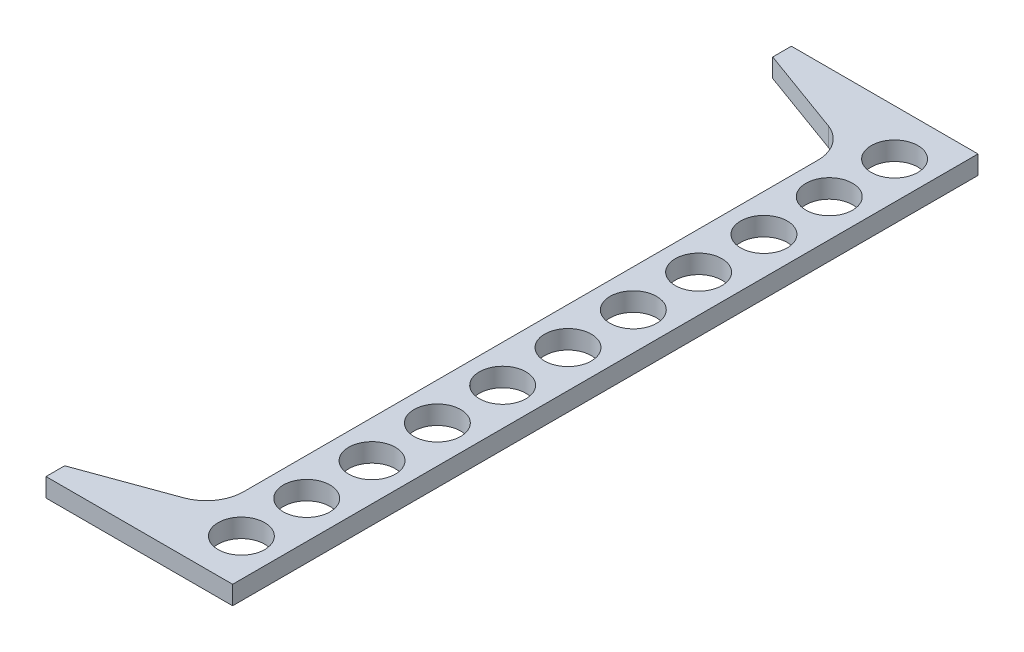
ISO-10303-21;
HEADER;
FILE_DESCRIPTION(('STEP AP214'),'2;1');
FILE_NAME('part.step','',(''),(''),'','','');
FILE_SCHEMA(('AUTOMOTIVE_DESIGN { 1 0 10303 214 1 1 1 1 }'));
ENDSEC;
DATA;
#1=APPLICATION_CONTEXT('core data for automotive mechanical design processes');
#2=APPLICATION_PROTOCOL_DEFINITION('international standard','automotive_design',2000,#1);
#3=PRODUCT_CONTEXT('',#1,'mechanical');
#4=PRODUCT('Part','Part','',(#3));
#5=PRODUCT_RELATED_PRODUCT_CATEGORY('part','',(#4));
#6=PRODUCT_DEFINITION_FORMATION('','',#4);
#7=PRODUCT_DEFINITION_CONTEXT('part definition',#1,'design');
#8=PRODUCT_DEFINITION('design','',#6,#7);
#9=PRODUCT_DEFINITION_SHAPE('','',#8);
#10=(LENGTH_UNIT() NAMED_UNIT(*) SI_UNIT(.MILLI.,.METRE.));
#11=(NAMED_UNIT(*) PLANE_ANGLE_UNIT() SI_UNIT($,.RADIAN.));
#12=(NAMED_UNIT(*) SI_UNIT($,.STERADIAN.) SOLID_ANGLE_UNIT());
#13=UNCERTAINTY_MEASURE_WITH_UNIT(LENGTH_MEASURE(1.E-05),#10,'distance_accuracy_value','');
#14=(GEOMETRIC_REPRESENTATION_CONTEXT(3) GLOBAL_UNCERTAINTY_ASSIGNED_CONTEXT((#13)) GLOBAL_UNIT_ASSIGNED_CONTEXT((#10,
#11,#12)) REPRESENTATION_CONTEXT('',''));
#15=CARTESIAN_POINT('',(0.,0.,0.));
#16=DIRECTION('',(0.,0.,1.));
#17=DIRECTION('',(1.,0.,0.));
#18=AXIS2_PLACEMENT_3D('',#15,#16,#17);
#19=CARTESIAN_POINT('',(50.8,6.35,-111.125));
#20=DIRECTION('',(0.,1.,0.));
#21=DIRECTION('',(0.,0.,1.));
#22=AXIS2_PLACEMENT_3D('',#19,#20,#21);
#23=CYLINDRICAL_SURFACE('',#22,7.9375);
#24=CARTESIAN_POINT('',(50.8,6.35,-111.125));
#25=DIRECTION('',(0.,1.,0.));
#26=DIRECTION('',(0.,0.,1.));
#27=AXIS2_PLACEMENT_3D('',#24,#25,#26);
#28=CIRCLE('',#27,7.9375);
#29=CARTESIAN_POINT('',(50.8,6.35,-103.1875));
#30=VERTEX_POINT('',#29);
#31=EDGE_CURVE('E40',#30,#30,#28,.T.);
#32=ORIENTED_EDGE('',*,*,#31,.T.);
#33=EDGE_LOOP('',(#32));
#34=FACE_BOUND('',#33,.T.);
#35=CARTESIAN_POINT('',(50.8,0.,-111.125));
#36=DIRECTION('',(0.,1.,0.));
#37=DIRECTION('',(0.,0.,1.));
#38=AXIS2_PLACEMENT_3D('',#35,#36,#37);
#39=CIRCLE('',#38,7.9375);
#40=CARTESIAN_POINT('',(50.8,0.,-103.1875));
#41=VERTEX_POINT('',#40);
#42=EDGE_CURVE('E11',#41,#41,#39,.T.);
#43=ORIENTED_EDGE('',*,*,#42,.F.);
#44=EDGE_LOOP('',(#43));
#45=FACE_BOUND('',#44,.T.);
#46=ADVANCED_FACE('F33',(#34,#45),#23,.F.);
#47=CARTESIAN_POINT('',(50.8,6.35,-88.9));
#48=DIRECTION('',(0.,1.,0.));
#49=DIRECTION('',(0.,0.,1.));
#50=AXIS2_PLACEMENT_3D('',#47,#48,#49);
#51=CYLINDRICAL_SURFACE('',#50,7.9375);
#52=CARTESIAN_POINT('',(50.8,6.35,-88.9));
#53=DIRECTION('',(0.,1.,0.));
#54=DIRECTION('',(0.,0.,1.));
#55=AXIS2_PLACEMENT_3D('',#52,#53,#54);
#56=CIRCLE('',#55,7.9375);
#57=CARTESIAN_POINT('',(50.8,6.35,-80.9625));
#58=VERTEX_POINT('',#57);
#59=EDGE_CURVE('E193',#58,#58,#56,.T.);
#60=ORIENTED_EDGE('',*,*,#59,.T.);
#61=EDGE_LOOP('',(#60));
#62=FACE_BOUND('',#61,.T.);
#63=CARTESIAN_POINT('',(50.8,0.,-88.9));
#64=DIRECTION('',(0.,1.,0.));
#65=DIRECTION('',(0.,0.,1.));
#66=AXIS2_PLACEMENT_3D('',#63,#64,#65);
#67=CIRCLE('',#66,7.9375);
#68=CARTESIAN_POINT('',(50.8,0.,-80.9625));
#69=VERTEX_POINT('',#68);
#70=EDGE_CURVE('E196',#69,#69,#67,.T.);
#71=ORIENTED_EDGE('',*,*,#70,.F.);
#72=EDGE_LOOP('',(#71));
#73=FACE_BOUND('',#72,.T.);
#74=ADVANCED_FACE('F220',(#62,#73),#51,.F.);
#75=CARTESIAN_POINT('',(50.8,6.35,-66.675));
#76=DIRECTION('',(0.,1.,0.));
#77=DIRECTION('',(0.,0.,1.));
#78=AXIS2_PLACEMENT_3D('',#75,#76,#77);
#79=CYLINDRICAL_SURFACE('',#78,7.9375);
#80=CARTESIAN_POINT('',(50.8,6.35,-66.675));
#81=DIRECTION('',(0.,1.,0.));
#82=DIRECTION('',(0.,0.,1.));
#83=AXIS2_PLACEMENT_3D('',#80,#81,#82);
#84=CIRCLE('',#83,7.9375);
#85=CARTESIAN_POINT('',(50.8,6.35,-58.7375));
#86=VERTEX_POINT('',#85);
#87=EDGE_CURVE('E187',#86,#86,#84,.T.);
#88=ORIENTED_EDGE('',*,*,#87,.T.);
#89=EDGE_LOOP('',(#88));
#90=FACE_BOUND('',#89,.T.);
#91=CARTESIAN_POINT('',(50.8,0.,-66.675));
#92=DIRECTION('',(0.,1.,0.));
#93=DIRECTION('',(0.,0.,1.));
#94=AXIS2_PLACEMENT_3D('',#91,#92,#93);
#95=CIRCLE('',#94,7.9375);
#96=CARTESIAN_POINT('',(50.8,0.,-58.7375));
#97=VERTEX_POINT('',#96);
#98=EDGE_CURVE('E190',#97,#97,#95,.T.);
#99=ORIENTED_EDGE('',*,*,#98,.F.);
#100=EDGE_LOOP('',(#99));
#101=FACE_BOUND('',#100,.T.);
#102=ADVANCED_FACE('F224',(#90,#101),#79,.F.);
#103=CARTESIAN_POINT('',(50.8,6.35,-44.45));
#104=DIRECTION('',(0.,1.,0.));
#105=DIRECTION('',(0.,0.,1.));
#106=AXIS2_PLACEMENT_3D('',#103,#104,#105);
#107=CYLINDRICAL_SURFACE('',#106,7.9375);
#108=CARTESIAN_POINT('',(50.8,6.35,-44.45));
#109=DIRECTION('',(0.,1.,0.));
#110=DIRECTION('',(0.,0.,1.));
#111=AXIS2_PLACEMENT_3D('',#108,#109,#110);
#112=CIRCLE('',#111,7.9375);
#113=CARTESIAN_POINT('',(50.8,6.35,-36.5125));
#114=VERTEX_POINT('',#113);
#115=EDGE_CURVE('E181',#114,#114,#112,.T.);
#116=ORIENTED_EDGE('',*,*,#115,.T.);
#117=EDGE_LOOP('',(#116));
#118=FACE_BOUND('',#117,.T.);
#119=CARTESIAN_POINT('',(50.8,0.,-44.45));
#120=DIRECTION('',(0.,1.,0.));
#121=DIRECTION('',(0.,0.,1.));
#122=AXIS2_PLACEMENT_3D('',#119,#120,#121);
#123=CIRCLE('',#122,7.9375);
#124=CARTESIAN_POINT('',(50.8,0.,-36.5125));
#125=VERTEX_POINT('',#124);
#126=EDGE_CURVE('E184',#125,#125,#123,.T.);
#127=ORIENTED_EDGE('',*,*,#126,.F.);
#128=EDGE_LOOP('',(#127));
#129=FACE_BOUND('',#128,.T.);
#130=ADVANCED_FACE('F229',(#118,#129),#107,.F.);
#131=CARTESIAN_POINT('',(0.,0.,126.8095));
#132=DIRECTION('',(-1.,0.,0.));
#133=DIRECTION('',(0.,0.,1.));
#134=AXIS2_PLACEMENT_3D('',#131,#132,#133);
#135=PLANE('',#134);
#136=DIRECTION('',(0.,-1.,0.));
#137=VECTOR('',#136,1.);
#138=CARTESIAN_POINT('',(0.,341.193377272515,-120.4595));
#139=LINE('',#138,#137);
#140=CARTESIAN_POINT('',(0.,6.35,-120.4595));
#141=VERTEX_POINT('',#140);
#142=CARTESIAN_POINT('',(0.,0.,-120.4595));
#143=VERTEX_POINT('',#142);
#144=EDGE_CURVE('E260',#141,#143,#139,.T.);
#145=ORIENTED_EDGE('',*,*,#144,.F.);
#146=DIRECTION('',(0.,0.,-1.));
#147=VECTOR('',#146,1.);
#148=CARTESIAN_POINT('',(0.,6.35,126.8095));
#149=LINE('',#148,#147);
#150=CARTESIAN_POINT('',(0.,6.35,-126.8095));
#151=VERTEX_POINT('',#150);
#152=EDGE_CURVE('E120',#141,#151,#149,.T.);
#153=ORIENTED_EDGE('',*,*,#152,.T.);
#154=DIRECTION('',(0.,1.,0.));
#155=VECTOR('',#154,1.);
#156=CARTESIAN_POINT('',(0.,0.,-126.8095));
#157=LINE('',#156,#155);
#158=CARTESIAN_POINT('',(0.,0.,-126.8095));
#159=VERTEX_POINT('',#158);
#160=EDGE_CURVE('E145',#159,#151,#157,.T.);
#161=ORIENTED_EDGE('',*,*,#160,.F.);
#162=DIRECTION('',(0.,0.,-1.));
#163=VECTOR('',#162,1.);
#164=CARTESIAN_POINT('',(0.,0.,126.8095));
#165=LINE('',#164,#163);
#166=EDGE_CURVE('E154',#143,#159,#165,.T.);
#167=ORIENTED_EDGE('',*,*,#166,.F.);
#168=EDGE_LOOP('',(#145,#153,#161,#167));
#169=FACE_BOUND('',#168,.T.);
#170=ADVANCED_FACE('F236',(#169),#135,.T.);
#171=DIRECTION('',(0.,-1.,0.));
#172=VECTOR('',#171,1.);
#173=CARTESIAN_POINT('',(0.,341.193377272515,120.4595));
#174=LINE('',#173,#172);
#175=CARTESIAN_POINT('',(0.,6.35,120.4595));
#176=VERTEX_POINT('',#175);
#177=CARTESIAN_POINT('',(0.,0.,120.4595));
#178=VERTEX_POINT('',#177);
#179=EDGE_CURVE('E265',#176,#178,#174,.T.);
#180=ORIENTED_EDGE('',*,*,#179,.T.);
#181=CARTESIAN_POINT('',(0.,0.,126.8095));
#182=VERTEX_POINT('',#181);
#183=EDGE_CURVE('E132',#182,#178,#165,.T.);
#184=ORIENTED_EDGE('',*,*,#183,.F.);
#185=DIRECTION('',(0.,1.,0.));
#186=VECTOR('',#185,1.);
#187=CARTESIAN_POINT('',(0.,0.,126.8095));
#188=LINE('',#187,#186);
#189=CARTESIAN_POINT('',(0.,6.35,126.8095));
#190=VERTEX_POINT('',#189);
#191=EDGE_CURVE('E125',#182,#190,#188,.T.);
#192=ORIENTED_EDGE('',*,*,#191,.T.);
#193=EDGE_CURVE('E109',#190,#176,#149,.T.);
#194=ORIENTED_EDGE('',*,*,#193,.T.);
#195=EDGE_LOOP('',(#180,#184,#192,#194));
#196=FACE_BOUND('',#195,.T.);
#197=ADVANCED_FACE('F130',(#196),#135,.T.);
#198=CARTESIAN_POINT('',(0.,0.,126.8095));
#199=DIRECTION('',(0.,1.,0.));
#200=DIRECTION('',(0.,0.,1.));
#201=AXIS2_PLACEMENT_3D('',#198,#199,#200);
#202=PLANE('',#201);
#203=CARTESIAN_POINT('',(50.8,0.,111.125));
#204=DIRECTION('',(0.,1.,0.));
#205=DIRECTION('',(0.,0.,1.));
#206=AXIS2_PLACEMENT_3D('',#203,#204,#205);
#207=CIRCLE('',#206,7.9375);
#208=CARTESIAN_POINT('',(50.8,0.,119.0625));
#209=VERTEX_POINT('',#208);
#210=EDGE_CURVE('E315',#209,#209,#207,.T.);
#211=ORIENTED_EDGE('',*,*,#210,.T.);
#212=EDGE_LOOP('',(#211));
#213=FACE_BOUND('',#212,.T.);
#214=CARTESIAN_POINT('',(50.8,0.,88.9));
#215=DIRECTION('',(0.,1.,0.));
#216=DIRECTION('',(0.,0.,1.));
#217=AXIS2_PLACEMENT_3D('',#214,#215,#216);
#218=CIRCLE('',#217,7.9375);
#219=CARTESIAN_POINT('',(50.8,0.,96.8375));
#220=VERTEX_POINT('',#219);
#221=EDGE_CURVE('E309',#220,#220,#218,.T.);
#222=ORIENTED_EDGE('',*,*,#221,.T.);
#223=EDGE_LOOP('',(#222));
#224=FACE_BOUND('',#223,.T.);
#225=CARTESIAN_POINT('',(50.8,0.,66.675));
#226=DIRECTION('',(0.,1.,0.));
#227=DIRECTION('',(0.,0.,1.));
#228=AXIS2_PLACEMENT_3D('',#225,#226,#227);
#229=CIRCLE('',#228,7.9375);
#230=CARTESIAN_POINT('',(50.8,0.,74.6125));
#231=VERTEX_POINT('',#230);
#232=EDGE_CURVE('E303',#231,#231,#229,.T.);
#233=ORIENTED_EDGE('',*,*,#232,.T.);
#234=EDGE_LOOP('',(#233));
#235=FACE_BOUND('',#234,.T.);
#236=CARTESIAN_POINT('',(50.8,0.,44.45));
#237=DIRECTION('',(0.,1.,0.));
#238=DIRECTION('',(0.,0.,1.));
#239=AXIS2_PLACEMENT_3D('',#236,#237,#238);
#240=CIRCLE('',#239,7.9375);
#241=CARTESIAN_POINT('',(50.8,0.,52.3875));
#242=VERTEX_POINT('',#241);
#243=EDGE_CURVE('E297',#242,#242,#240,.T.);
#244=ORIENTED_EDGE('',*,*,#243,.T.);
#245=EDGE_LOOP('',(#244));
#246=FACE_BOUND('',#245,.T.);
#247=CARTESIAN_POINT('',(50.8,0.,22.225));
#248=DIRECTION('',(0.,1.,0.));
#249=DIRECTION('',(0.,0.,1.));
#250=AXIS2_PLACEMENT_3D('',#247,#248,#249);
#251=CIRCLE('',#250,7.9375);
#252=CARTESIAN_POINT('',(50.8,0.,30.1625));
#253=VERTEX_POINT('',#252);
#254=EDGE_CURVE('E291',#253,#253,#251,.T.);
#255=ORIENTED_EDGE('',*,*,#254,.T.);
#256=EDGE_LOOP('',(#255));
#257=FACE_BOUND('',#256,.T.);
#258=CARTESIAN_POINT('',(50.8,0.,-22.225));
#259=DIRECTION('',(0.,1.,0.));
#260=DIRECTION('',(0.,0.,1.));
#261=AXIS2_PLACEMENT_3D('',#258,#259,#260);
#262=CIRCLE('',#261,7.9375);
#263=CARTESIAN_POINT('',(50.8,0.,-14.2875));
#264=VERTEX_POINT('',#263);
#265=EDGE_CURVE('E285',#264,#264,#262,.T.);
#266=ORIENTED_EDGE('',*,*,#265,.T.);
#267=EDGE_LOOP('',(#266));
#268=FACE_BOUND('',#267,.T.);
#269=CARTESIAN_POINT('',(50.8,0.,0.));
#270=DIRECTION('',(0.,1.,0.));
#271=DIRECTION('',(0.,0.,1.));
#272=AXIS2_PLACEMENT_3D('',#269,#270,#271);
#273=CIRCLE('',#272,7.9375);
#274=CARTESIAN_POINT('',(50.8,0.,7.9375));
#275=VERTEX_POINT('',#274);
#276=EDGE_CURVE('E279',#275,#275,#273,.T.);
#277=ORIENTED_EDGE('',*,*,#276,.T.);
#278=EDGE_LOOP('',(#277));
#279=FACE_BOUND('',#278,.T.);
#280=DIRECTION('',(0.939692620785911,0.,-0.342020143325663));
#281=VECTOR('',#280,1.);
#282=CARTESIAN_POINT('',(-2.04085066075473,0.,121.202308893097));
#283=LINE('',#282,#281);
#284=CARTESIAN_POINT('',(29.743655820236,0.,109.633694623176));
#285=VERTEX_POINT('',#284);
#286=EDGE_CURVE('E264',#178,#285,#283,.T.);
#287=ORIENTED_EDGE('',*,*,#286,.T.);
#288=CARTESIAN_POINT('',(25.4,0.,97.6995983391946));
#289=DIRECTION('',(0.,1.,0.));
#290=DIRECTION('',(0.,0.,1.));
#291=AXIS2_PLACEMENT_3D('',#288,#289,#290);
#292=CIRCLE('',#291,12.7);
#293=CARTESIAN_POINT('',(38.1,0.,97.6995983391946));
#294=VERTEX_POINT('',#293);
#295=EDGE_CURVE('E174',#285,#294,#292,.T.);
#296=ORIENTED_EDGE('',*,*,#295,.T.);
#297=DIRECTION('',(0.,0.,-1.));
#298=VECTOR('',#297,1.);
#299=CARTESIAN_POINT('',(38.1,0.,126.8095));
#300=LINE('',#299,#298);
#301=CARTESIAN_POINT('',(38.1,0.,-97.6995983391944));
#302=VERTEX_POINT('',#301);
#303=EDGE_CURVE('E274',#294,#302,#300,.T.);
#304=ORIENTED_EDGE('',*,*,#303,.T.);
#305=CARTESIAN_POINT('',(25.4,0.,-97.6995983391944));
#306=DIRECTION('',(0.,1.,0.));
#307=DIRECTION('',(0.,0.,1.));
#308=AXIS2_PLACEMENT_3D('',#305,#306,#307);
#309=CIRCLE('',#308,12.7);
#310=CARTESIAN_POINT('',(29.743655820236,0.,-109.633694623175));
#311=VERTEX_POINT('',#310);
#312=EDGE_CURVE('E55',#302,#311,#309,.T.);
#313=ORIENTED_EDGE('',*,*,#312,.T.);
#314=DIRECTION('',(-0.939692620785908,0.,-0.342020143325669));
#315=VECTOR('',#314,1.);
#316=CARTESIAN_POINT('',(79.4707247297906,0.,-91.5345217027932));
#317=LINE('',#316,#315);
#318=EDGE_CURVE('E139',#311,#143,#317,.T.);
#319=ORIENTED_EDGE('',*,*,#318,.T.);
#320=ORIENTED_EDGE('',*,*,#166,.T.);
#321=DIRECTION('',(1.,0.,0.));
#322=VECTOR('',#321,1.);
#323=CARTESIAN_POINT('',(0.,0.,-126.8095));
#324=LINE('',#323,#322);
#325=CARTESIAN_POINT('',(63.5,0.,-126.8095));
#326=VERTEX_POINT('',#325);
#327=EDGE_CURVE('E134',#159,#326,#324,.T.);
#328=ORIENTED_EDGE('',*,*,#327,.T.);
#329=DIRECTION('',(0.,0.,-1.));
#330=VECTOR('',#329,1.);
#331=CARTESIAN_POINT('',(63.5,0.,126.8095));
#332=LINE('',#331,#330);
#333=CARTESIAN_POINT('',(63.5,0.,126.8095));
#334=VERTEX_POINT('',#333);
#335=EDGE_CURVE('E155',#334,#326,#332,.T.);
#336=ORIENTED_EDGE('',*,*,#335,.F.);
#337=DIRECTION('',(1.,0.,0.));
#338=VECTOR('',#337,1.);
#339=CARTESIAN_POINT('',(0.,0.,126.8095));
#340=LINE('',#339,#338);
#341=EDGE_CURVE('E143',#182,#334,#340,.T.);
#342=ORIENTED_EDGE('',*,*,#341,.F.);
#343=ORIENTED_EDGE('',*,*,#183,.T.);
#344=EDGE_LOOP('',(#287,#296,#304,#313,#319,#320,#328,#336,#342,#343));
#345=FACE_BOUND('',#344,.T.);
#346=ORIENTED_EDGE('',*,*,#126,.T.);
#347=EDGE_LOOP('',(#346));
#348=FACE_BOUND('',#347,.T.);
#349=ORIENTED_EDGE('',*,*,#98,.T.);
#350=EDGE_LOOP('',(#349));
#351=FACE_BOUND('',#350,.T.);
#352=ORIENTED_EDGE('',*,*,#70,.T.);
#353=EDGE_LOOP('',(#352));
#354=FACE_BOUND('',#353,.T.);
#355=ORIENTED_EDGE('',*,*,#42,.T.);
#356=EDGE_LOOP('',(#355));
#357=FACE_BOUND('',#356,.T.);
#358=ADVANCED_FACE('F213',(#213,#224,#235,#246,#257,#268,#279,#345,#348,#351,#354,#357),#202,.F.);
#359=CARTESIAN_POINT('',(63.5,0.,126.8095));
#360=DIRECTION('',(-1.,0.,0.));
#361=DIRECTION('',(0.,0.,1.));
#362=AXIS2_PLACEMENT_3D('',#359,#360,#361);
#363=PLANE('',#362);
#364=DIRECTION('',(0.,1.,0.));
#365=VECTOR('',#364,1.);
#366=CARTESIAN_POINT('',(63.5,0.,-126.8095));
#367=LINE('',#366,#365);
#368=CARTESIAN_POINT('',(63.5,6.35,-126.8095));
#369=VERTEX_POINT('',#368);
#370=EDGE_CURVE('E136',#326,#369,#367,.T.);
#371=ORIENTED_EDGE('',*,*,#370,.T.);
#372=DIRECTION('',(0.,0.,-1.));
#373=VECTOR('',#372,1.);
#374=CARTESIAN_POINT('',(63.5,6.35,126.8095));
#375=LINE('',#374,#373);
#376=CARTESIAN_POINT('',(63.5,6.35,126.8095));
#377=VERTEX_POINT('',#376);
#378=EDGE_CURVE('E119',#377,#369,#375,.T.);
#379=ORIENTED_EDGE('',*,*,#378,.F.);
#380=DIRECTION('',(0.,1.,0.));
#381=VECTOR('',#380,1.);
#382=CARTESIAN_POINT('',(63.5,0.,126.8095));
#383=LINE('',#382,#381);
#384=EDGE_CURVE('E127',#334,#377,#383,.T.);
#385=ORIENTED_EDGE('',*,*,#384,.F.);
#386=ORIENTED_EDGE('',*,*,#335,.T.);
#387=EDGE_LOOP('',(#371,#379,#385,#386));
#388=FACE_BOUND('',#387,.T.);
#389=ADVANCED_FACE('F204',(#388),#363,.F.);
#390=CARTESIAN_POINT('',(0.,6.35,126.8095));
#391=DIRECTION('',(0.,1.,0.));
#392=DIRECTION('',(0.,0.,1.));
#393=AXIS2_PLACEMENT_3D('',#390,#391,#392);
#394=PLANE('',#393);
#395=CARTESIAN_POINT('',(50.8,6.35,111.125));
#396=DIRECTION('',(0.,1.,0.));
#397=DIRECTION('',(0.,0.,1.));
#398=AXIS2_PLACEMENT_3D('',#395,#396,#397);
#399=CIRCLE('',#398,7.9375);
#400=CARTESIAN_POINT('',(50.8,6.35,119.0625));
#401=VERTEX_POINT('',#400);
#402=EDGE_CURVE('E318',#401,#401,#399,.T.);
#403=ORIENTED_EDGE('',*,*,#402,.F.);
#404=EDGE_LOOP('',(#403));
#405=FACE_BOUND('',#404,.T.);
#406=CARTESIAN_POINT('',(50.8,6.35,88.9));
#407=DIRECTION('',(0.,1.,0.));
#408=DIRECTION('',(0.,0.,1.));
#409=AXIS2_PLACEMENT_3D('',#406,#407,#408);
#410=CIRCLE('',#409,7.9375);
#411=CARTESIAN_POINT('',(50.8,6.35,96.8375));
#412=VERTEX_POINT('',#411);
#413=EDGE_CURVE('E312',#412,#412,#410,.T.);
#414=ORIENTED_EDGE('',*,*,#413,.F.);
#415=EDGE_LOOP('',(#414));
#416=FACE_BOUND('',#415,.T.);
#417=CARTESIAN_POINT('',(50.8,6.35,66.675));
#418=DIRECTION('',(0.,1.,0.));
#419=DIRECTION('',(0.,0.,1.));
#420=AXIS2_PLACEMENT_3D('',#417,#418,#419);
#421=CIRCLE('',#420,7.9375);
#422=CARTESIAN_POINT('',(50.8,6.35,74.6125));
#423=VERTEX_POINT('',#422);
#424=EDGE_CURVE('E306',#423,#423,#421,.T.);
#425=ORIENTED_EDGE('',*,*,#424,.F.);
#426=EDGE_LOOP('',(#425));
#427=FACE_BOUND('',#426,.T.);
#428=CARTESIAN_POINT('',(50.8,6.35,44.45));
#429=DIRECTION('',(0.,1.,0.));
#430=DIRECTION('',(0.,0.,1.));
#431=AXIS2_PLACEMENT_3D('',#428,#429,#430);
#432=CIRCLE('',#431,7.9375);
#433=CARTESIAN_POINT('',(50.8,6.35,52.3875));
#434=VERTEX_POINT('',#433);
#435=EDGE_CURVE('E300',#434,#434,#432,.T.);
#436=ORIENTED_EDGE('',*,*,#435,.F.);
#437=EDGE_LOOP('',(#436));
#438=FACE_BOUND('',#437,.T.);
#439=CARTESIAN_POINT('',(50.8,6.35,22.225));
#440=DIRECTION('',(0.,1.,0.));
#441=DIRECTION('',(0.,0.,1.));
#442=AXIS2_PLACEMENT_3D('',#439,#440,#441);
#443=CIRCLE('',#442,7.9375);
#444=CARTESIAN_POINT('',(50.8,6.35,30.1625));
#445=VERTEX_POINT('',#444);
#446=EDGE_CURVE('E294',#445,#445,#443,.T.);
#447=ORIENTED_EDGE('',*,*,#446,.F.);
#448=EDGE_LOOP('',(#447));
#449=FACE_BOUND('',#448,.T.);
#450=CARTESIAN_POINT('',(50.8,6.35,-22.225));
#451=DIRECTION('',(0.,1.,0.));
#452=DIRECTION('',(0.,0.,1.));
#453=AXIS2_PLACEMENT_3D('',#450,#451,#452);
#454=CIRCLE('',#453,7.9375);
#455=CARTESIAN_POINT('',(50.8,6.35,-14.2875));
#456=VERTEX_POINT('',#455);
#457=EDGE_CURVE('E288',#456,#456,#454,.T.);
#458=ORIENTED_EDGE('',*,*,#457,.F.);
#459=EDGE_LOOP('',(#458));
#460=FACE_BOUND('',#459,.T.);
#461=CARTESIAN_POINT('',(50.8,6.35,0.));
#462=DIRECTION('',(0.,1.,0.));
#463=DIRECTION('',(0.,0.,1.));
#464=AXIS2_PLACEMENT_3D('',#461,#462,#463);
#465=CIRCLE('',#464,7.9375);
#466=CARTESIAN_POINT('',(50.8,6.35,7.9375));
#467=VERTEX_POINT('',#466);
#468=EDGE_CURVE('E282',#467,#467,#465,.T.);
#469=ORIENTED_EDGE('',*,*,#468,.F.);
#470=EDGE_LOOP('',(#469));
#471=FACE_BOUND('',#470,.T.);
#472=DIRECTION('',(-0.939692620785908,0.,-0.342020143325669));
#473=VECTOR('',#472,1.);
#474=CARTESIAN_POINT('',(79.4707247297906,6.35,-91.5345217027932));
#475=LINE('',#474,#473);
#476=CARTESIAN_POINT('',(29.743655820236,6.35,-109.633694623175));
#477=VERTEX_POINT('',#476);
#478=EDGE_CURVE('E163',#477,#141,#475,.T.);
#479=ORIENTED_EDGE('',*,*,#478,.F.);
#480=CARTESIAN_POINT('',(25.4,6.35000000000002,-97.6995983391944));
#481=DIRECTION('',(0.,1.,0.));
#482=DIRECTION('',(0.,0.,1.));
#483=AXIS2_PLACEMENT_3D('',#480,#481,#482);
#484=CIRCLE('',#483,12.7);
#485=CARTESIAN_POINT('',(38.1,6.35,-97.6995983391944));
#486=VERTEX_POINT('',#485);
#487=EDGE_CURVE('E179',#477,#486,#484,.F.);
#488=ORIENTED_EDGE('',*,*,#487,.T.);
#489=DIRECTION('',(0.,0.,-1.));
#490=VECTOR('',#489,1.);
#491=CARTESIAN_POINT('',(38.1,6.35,126.8095));
#492=LINE('',#491,#490);
#493=CARTESIAN_POINT('',(38.1,6.35,97.6995983391946));
#494=VERTEX_POINT('',#493);
#495=EDGE_CURVE('E160',#494,#486,#492,.T.);
#496=ORIENTED_EDGE('',*,*,#495,.F.);
#497=CARTESIAN_POINT('',(25.4,6.35000000000002,97.6995983391946));
#498=DIRECTION('',(0.,1.,0.));
#499=DIRECTION('',(0.,0.,1.));
#500=AXIS2_PLACEMENT_3D('',#497,#498,#499);
#501=CIRCLE('',#500,12.7);
#502=CARTESIAN_POINT('',(29.743655820236,6.35,109.633694623176));
#503=VERTEX_POINT('',#502);
#504=EDGE_CURVE('E176',#494,#503,#501,.F.);
#505=ORIENTED_EDGE('',*,*,#504,.T.);
#506=DIRECTION('',(0.939692620785911,0.,-0.342020143325663));
#507=VECTOR('',#506,1.);
#508=CARTESIAN_POINT('',(-2.04085066075473,6.35,121.202308893097));
#509=LINE('',#508,#507);
#510=EDGE_CURVE('E115',#176,#503,#509,.T.);
#511=ORIENTED_EDGE('',*,*,#510,.F.);
#512=ORIENTED_EDGE('',*,*,#193,.F.);
#513=DIRECTION('',(1.,0.,0.));
#514=VECTOR('',#513,1.);
#515=CARTESIAN_POINT('',(0.,6.35,126.8095));
#516=LINE('',#515,#514);
#517=EDGE_CURVE('E113',#190,#377,#516,.T.);
#518=ORIENTED_EDGE('',*,*,#517,.T.);
#519=ORIENTED_EDGE('',*,*,#378,.T.);
#520=DIRECTION('',(1.,0.,0.));
#521=VECTOR('',#520,1.);
#522=CARTESIAN_POINT('',(0.,6.35,-126.8095));
#523=LINE('',#522,#521);
#524=EDGE_CURVE('E148',#151,#369,#523,.T.);
#525=ORIENTED_EDGE('',*,*,#524,.F.);
#526=ORIENTED_EDGE('',*,*,#152,.F.);
#527=EDGE_LOOP('',(#479,#488,#496,#505,#511,#512,#518,#519,#525,#526));
#528=FACE_BOUND('',#527,.T.);
#529=ORIENTED_EDGE('',*,*,#115,.F.);
#530=EDGE_LOOP('',(#529));
#531=FACE_BOUND('',#530,.T.);
#532=ORIENTED_EDGE('',*,*,#87,.F.);
#533=EDGE_LOOP('',(#532));
#534=FACE_BOUND('',#533,.T.);
#535=ORIENTED_EDGE('',*,*,#59,.F.);
#536=EDGE_LOOP('',(#535));
#537=FACE_BOUND('',#536,.T.);
#538=ORIENTED_EDGE('',*,*,#31,.F.);
#539=EDGE_LOOP('',(#538));
#540=FACE_BOUND('',#539,.T.);
#541=ADVANCED_FACE('F111',(#405,#416,#427,#438,#449,#460,#471,#528,#531,#534,#537,#540),#394,.T.);
#542=CARTESIAN_POINT('',(0.,0.,126.8095));
#543=DIRECTION('',(0.,0.,-1.));
#544=DIRECTION('',(-1.,0.,0.));
#545=AXIS2_PLACEMENT_3D('',#542,#543,#544);
#546=PLANE('',#545);
#547=ORIENTED_EDGE('',*,*,#191,.F.);
#548=ORIENTED_EDGE('',*,*,#341,.T.);
#549=ORIENTED_EDGE('',*,*,#384,.T.);
#550=ORIENTED_EDGE('',*,*,#517,.F.);
#551=EDGE_LOOP('',(#547,#548,#549,#550));
#552=FACE_BOUND('',#551,.T.);
#553=ADVANCED_FACE('F124',(#552),#546,.F.);
#554=CARTESIAN_POINT('',(0.,0.,-126.8095));
#555=DIRECTION('',(0.,0.,-1.));
#556=DIRECTION('',(-1.,0.,0.));
#557=AXIS2_PLACEMENT_3D('',#554,#555,#556);
#558=PLANE('',#557);
#559=ORIENTED_EDGE('',*,*,#160,.T.);
#560=ORIENTED_EDGE('',*,*,#524,.T.);
#561=ORIENTED_EDGE('',*,*,#370,.F.);
#562=ORIENTED_EDGE('',*,*,#327,.F.);
#563=EDGE_LOOP('',(#559,#560,#561,#562));
#564=FACE_BOUND('',#563,.T.);
#565=ADVANCED_FACE('F211',(#564),#558,.T.);
#566=CARTESIAN_POINT('',(0.,341.193377272515,-120.4595));
#567=DIRECTION('',(0.342020143325669,0.,-0.939692620785908));
#568=DIRECTION('',(-0.939692620785908,0.,-0.342020143325669));
#569=AXIS2_PLACEMENT_3D('',#566,#567,#568);
#570=PLANE('',#569);
#571=ORIENTED_EDGE('',*,*,#318,.F.);
#572=DIRECTION('',(0.,-1.,0.));
#573=VECTOR('',#572,1.);
#574=CARTESIAN_POINT('',(29.743655820236,6.35000000000013,-109.633694623175));
#575=LINE('',#574,#573);
#576=EDGE_CURVE('E47',#311,#477,#575,.F.);
#577=ORIENTED_EDGE('',*,*,#576,.T.);
#578=ORIENTED_EDGE('',*,*,#478,.T.);
#579=ORIENTED_EDGE('',*,*,#144,.T.);
#580=EDGE_LOOP('',(#571,#577,#578,#579));
#581=FACE_BOUND('',#580,.T.);
#582=ADVANCED_FACE('F358',(#581),#570,.F.);
#583=CARTESIAN_POINT('',(38.1,341.193377272515,-106.592234074458));
#584=DIRECTION('',(1.,0.,0.));
#585=DIRECTION('',(0.,0.,-1.));
#586=AXIS2_PLACEMENT_3D('',#583,#584,#585);
#587=PLANE('',#586);
#588=ORIENTED_EDGE('',*,*,#303,.F.);
#589=DIRECTION('',(0.,-1.,0.));
#590=VECTOR('',#589,1.);
#591=CARTESIAN_POINT('',(38.1,6.35000000000013,97.6995983391946));
#592=LINE('',#591,#590);
#593=EDGE_CURVE('E171',#294,#494,#592,.F.);
#594=ORIENTED_EDGE('',*,*,#593,.T.);
#595=ORIENTED_EDGE('',*,*,#495,.T.);
#596=DIRECTION('',(0.,-1.,0.));
#597=VECTOR('',#596,1.);
#598=CARTESIAN_POINT('',(38.1,1.11022302462516E-13,-97.6995983391944));
#599=LINE('',#598,#597);
#600=EDGE_CURVE('E168',#486,#302,#599,.T.);
#601=ORIENTED_EDGE('',*,*,#600,.T.);
#602=EDGE_LOOP('',(#588,#594,#595,#601));
#603=FACE_BOUND('',#602,.T.);
#604=ADVANCED_FACE('F354',(#603),#587,.F.);
#605=CARTESIAN_POINT('',(38.1,341.193377272515,106.592234074458));
#606=DIRECTION('',(0.342020143325663,0.,0.939692620785911));
#607=DIRECTION('',(0.939692620785911,0.,-0.342020143325663));
#608=AXIS2_PLACEMENT_3D('',#605,#606,#607);
#609=PLANE('',#608);
#610=ORIENTED_EDGE('',*,*,#510,.T.);
#611=DIRECTION('',(0.,-1.,0.));
#612=VECTOR('',#611,1.);
#613=CARTESIAN_POINT('',(29.743655820236,1.11022302462516E-13,109.633694623176));
#614=LINE('',#613,#612);
#615=EDGE_CURVE('E165',#503,#285,#614,.T.);
#616=ORIENTED_EDGE('',*,*,#615,.T.);
#617=ORIENTED_EDGE('',*,*,#286,.F.);
#618=ORIENTED_EDGE('',*,*,#179,.F.);
#619=EDGE_LOOP('',(#610,#616,#617,#618));
#620=FACE_BOUND('',#619,.T.);
#621=ADVANCED_FACE('F245',(#620),#609,.F.);
#622=CARTESIAN_POINT('',(25.4,341.193377272515,97.6995983391946));
#623=DIRECTION('',(0.,1.,0.));
#624=DIRECTION('',(0.,0.,1.));
#625=AXIS2_PLACEMENT_3D('',#622,#623,#624);
#626=CYLINDRICAL_SURFACE('',#625,12.7);
#627=ORIENTED_EDGE('',*,*,#504,.F.);
#628=ORIENTED_EDGE('',*,*,#593,.F.);
#629=ORIENTED_EDGE('',*,*,#295,.F.);
#630=ORIENTED_EDGE('',*,*,#615,.F.);
#631=EDGE_LOOP('',(#627,#628,#629,#630));
#632=FACE_BOUND('',#631,.T.);
#633=ADVANCED_FACE('F242',(#632),#626,.F.);
#634=CARTESIAN_POINT('',(25.4,341.193377272515,-97.6995983391944));
#635=DIRECTION('',(0.,1.,0.));
#636=DIRECTION('',(0.,0.,1.));
#637=AXIS2_PLACEMENT_3D('',#634,#635,#636);
#638=CYLINDRICAL_SURFACE('',#637,12.7);
#639=ORIENTED_EDGE('',*,*,#487,.F.);
#640=ORIENTED_EDGE('',*,*,#576,.F.);
#641=ORIENTED_EDGE('',*,*,#312,.F.);
#642=ORIENTED_EDGE('',*,*,#600,.F.);
#643=EDGE_LOOP('',(#639,#640,#641,#642));
#644=FACE_BOUND('',#643,.T.);
#645=ADVANCED_FACE('F238',(#644),#638,.F.);
#646=CARTESIAN_POINT('',(50.8,6.35,0.));
#647=DIRECTION('',(0.,1.,0.));
#648=DIRECTION('',(0.,0.,1.));
#649=AXIS2_PLACEMENT_3D('',#646,#647,#648);
#650=CYLINDRICAL_SURFACE('',#649,7.9375);
#651=ORIENTED_EDGE('',*,*,#468,.T.);
#652=EDGE_LOOP('',(#651));
#653=FACE_BOUND('',#652,.T.);
#654=ORIENTED_EDGE('',*,*,#276,.F.);
#655=EDGE_LOOP('',(#654));
#656=FACE_BOUND('',#655,.T.);
#657=ADVANCED_FACE('F241',(#653,#656),#650,.F.);
#658=CARTESIAN_POINT('',(50.8,6.35,-22.225));
#659=DIRECTION('',(0.,1.,0.));
#660=DIRECTION('',(0.,0.,1.));
#661=AXIS2_PLACEMENT_3D('',#658,#659,#660);
#662=CYLINDRICAL_SURFACE('',#661,7.9375);
#663=ORIENTED_EDGE('',*,*,#457,.T.);
#664=EDGE_LOOP('',(#663));
#665=FACE_BOUND('',#664,.T.);
#666=ORIENTED_EDGE('',*,*,#265,.F.);
#667=EDGE_LOOP('',(#666));
#668=FACE_BOUND('',#667,.T.);
#669=ADVANCED_FACE('F341',(#665,#668),#662,.F.);
#670=CARTESIAN_POINT('',(50.8,6.35,22.225));
#671=DIRECTION('',(0.,1.,0.));
#672=DIRECTION('',(0.,0.,1.));
#673=AXIS2_PLACEMENT_3D('',#670,#671,#672);
#674=CYLINDRICAL_SURFACE('',#673,7.9375);
#675=ORIENTED_EDGE('',*,*,#446,.T.);
#676=EDGE_LOOP('',(#675));
#677=FACE_BOUND('',#676,.T.);
#678=ORIENTED_EDGE('',*,*,#254,.F.);
#679=EDGE_LOOP('',(#678));
#680=FACE_BOUND('',#679,.T.);
#681=ADVANCED_FACE('F347',(#677,#680),#674,.F.);
#682=CARTESIAN_POINT('',(50.8,6.35,44.45));
#683=DIRECTION('',(0.,1.,0.));
#684=DIRECTION('',(0.,0.,1.));
#685=AXIS2_PLACEMENT_3D('',#682,#683,#684);
#686=CYLINDRICAL_SURFACE('',#685,7.9375);
#687=ORIENTED_EDGE('',*,*,#435,.T.);
#688=EDGE_LOOP('',(#687));
#689=FACE_BOUND('',#688,.T.);
#690=ORIENTED_EDGE('',*,*,#243,.F.);
#691=EDGE_LOOP('',(#690));
#692=FACE_BOUND('',#691,.T.);
#693=ADVANCED_FACE('F439',(#689,#692),#686,.F.);
#694=CARTESIAN_POINT('',(50.8,6.35,66.675));
#695=DIRECTION('',(0.,1.,0.));
#696=DIRECTION('',(0.,0.,1.));
#697=AXIS2_PLACEMENT_3D('',#694,#695,#696);
#698=CYLINDRICAL_SURFACE('',#697,7.9375);
#699=ORIENTED_EDGE('',*,*,#424,.T.);
#700=EDGE_LOOP('',(#699));
#701=FACE_BOUND('',#700,.T.);
#702=ORIENTED_EDGE('',*,*,#232,.F.);
#703=EDGE_LOOP('',(#702));
#704=FACE_BOUND('',#703,.T.);
#705=ADVANCED_FACE('F448',(#701,#704),#698,.F.);
#706=CARTESIAN_POINT('',(50.8,6.35,88.9));
#707=DIRECTION('',(0.,1.,0.));
#708=DIRECTION('',(0.,0.,1.));
#709=AXIS2_PLACEMENT_3D('',#706,#707,#708);
#710=CYLINDRICAL_SURFACE('',#709,7.9375);
#711=ORIENTED_EDGE('',*,*,#413,.T.);
#712=EDGE_LOOP('',(#711));
#713=FACE_BOUND('',#712,.T.);
#714=ORIENTED_EDGE('',*,*,#221,.F.);
#715=EDGE_LOOP('',(#714));
#716=FACE_BOUND('',#715,.T.);
#717=ADVANCED_FACE('F324',(#713,#716),#710,.F.);
#718=CARTESIAN_POINT('',(50.8,6.35,111.125));
#719=DIRECTION('',(0.,1.,0.));
#720=DIRECTION('',(0.,0.,1.));
#721=AXIS2_PLACEMENT_3D('',#718,#719,#720);
#722=CYLINDRICAL_SURFACE('',#721,7.9375);
#723=ORIENTED_EDGE('',*,*,#402,.T.);
#724=EDGE_LOOP('',(#723));
#725=FACE_BOUND('',#724,.T.);
#726=ORIENTED_EDGE('',*,*,#210,.F.);
#727=EDGE_LOOP('',(#726));
#728=FACE_BOUND('',#727,.T.);
#729=ADVANCED_FACE('F321',(#725,#728),#722,.F.);
#730=CLOSED_SHELL('',(#46,#74,#102,#130,#170,#197,#358,#389,#541,#553,#565,#582,#604,#621,#633,
#645,#657,#669,#681,#693,#705,#717,#729));
#731=MANIFOLD_SOLID_BREP('B2',#730);
#732=ADVANCED_BREP_SHAPE_REPRESENTATION('',(#18,#731),#14);
#733=SHAPE_DEFINITION_REPRESENTATION(#9,#732);
ENDSEC;
END-ISO-10303-21;
